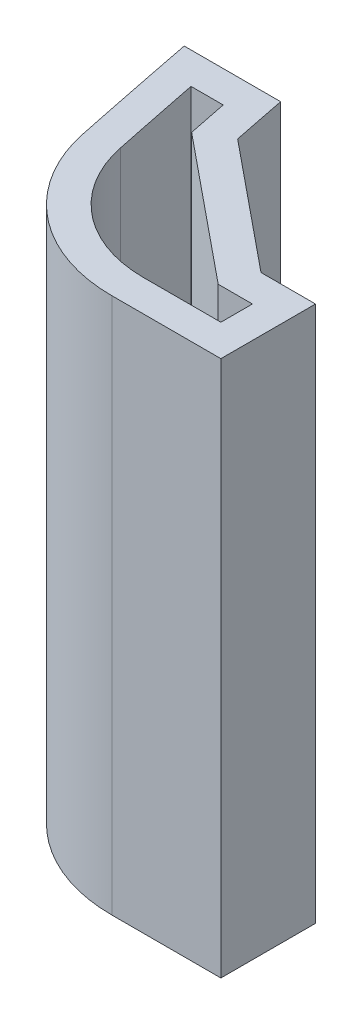
ISO-10303-21;
HEADER;
FILE_DESCRIPTION(('STEP AP214'),'2;1');
FILE_NAME('part.step','',(''),(''),'','','');
FILE_SCHEMA(('AUTOMOTIVE_DESIGN { 1 0 10303 214 1 1 1 1 }'));
ENDSEC;
DATA;
#1=APPLICATION_CONTEXT('core data for automotive mechanical design processes');
#2=APPLICATION_PROTOCOL_DEFINITION('international standard','automotive_design',2000,#1);
#3=PRODUCT_CONTEXT('',#1,'mechanical');
#4=PRODUCT('Part','Part','',(#3));
#5=PRODUCT_RELATED_PRODUCT_CATEGORY('part','',(#4));
#6=PRODUCT_DEFINITION_FORMATION('','',#4);
#7=PRODUCT_DEFINITION_CONTEXT('part definition',#1,'design');
#8=PRODUCT_DEFINITION('design','',#6,#7);
#9=PRODUCT_DEFINITION_SHAPE('','',#8);
#10=(LENGTH_UNIT() NAMED_UNIT(*) SI_UNIT(.MILLI.,.METRE.));
#11=(NAMED_UNIT(*) PLANE_ANGLE_UNIT() SI_UNIT($,.RADIAN.));
#12=(NAMED_UNIT(*) SI_UNIT($,.STERADIAN.) SOLID_ANGLE_UNIT());
#13=UNCERTAINTY_MEASURE_WITH_UNIT(LENGTH_MEASURE(1.E-05),#10,'distance_accuracy_value','');
#14=(GEOMETRIC_REPRESENTATION_CONTEXT(3) GLOBAL_UNCERTAINTY_ASSIGNED_CONTEXT((#13)) GLOBAL_UNIT_ASSIGNED_CONTEXT((#10,
#11,#12)) REPRESENTATION_CONTEXT('',''));
#15=CARTESIAN_POINT('',(0.,0.,0.));
#16=DIRECTION('',(0.,0.,1.));
#17=DIRECTION('',(1.,0.,0.));
#18=AXIS2_PLACEMENT_3D('',#15,#16,#17);
#19=CARTESIAN_POINT('',(330.920316322646,17.,-69.4714206759016));
#20=DIRECTION('',(0.,1.,0.));
#21=DIRECTION('',(0.,0.,1.));
#22=AXIS2_PLACEMENT_3D('',#19,#20,#21);
#23=PLANE('',#22);
#24=CARTESIAN_POINT('',(330.920316322646,17.,-69.4714206759016));
#25=DIRECTION('',(0.,1.,0.));
#26=DIRECTION('',(0.,0.,1.));
#27=AXIS2_PLACEMENT_3D('',#24,#25,#26);
#28=CIRCLE('',#27,341.640625);
#29=CARTESIAN_POINT('',(-4.38263124923281,17.,-3.97142067590166));
#30=VERTEX_POINT('',#29);
#31=CARTESIAN_POINT('',(-3.57280317699689,17.,0.0459847545927368));
#32=VERTEX_POINT('',#31);
#33=EDGE_CURVE('E244',#30,#32,#28,.T.);
#34=ORIENTED_EDGE('',*,*,#33,.T.);
#35=CARTESIAN_POINT('',(1.32259120854557,17.,-0.971420675901571));
#36=DIRECTION('',(0.,1.,0.));
#37=DIRECTION('',(0.,0.,1.));
#38=AXIS2_PLACEMENT_3D('',#35,#36,#37);
#39=CIRCLE('',#38,4.99999999999999);
#40=CARTESIAN_POINT('',(1.32259120854557,17.,4.02857932409845));
#41=VERTEX_POINT('',#40);
#42=EDGE_CURVE('E248',#32,#41,#39,.T.);
#43=ORIENTED_EDGE('',*,*,#42,.T.);
#44=DIRECTION('',(1.,0.,0.));
#45=VECTOR('',#44,1.);
#46=CARTESIAN_POINT('',(1.32259120854557,17.,4.02857932409845));
#47=LINE('',#46,#45);
#48=CARTESIAN_POINT('',(4.77969132264679,17.,4.02857932409843));
#49=VERTEX_POINT('',#48);
#50=EDGE_CURVE('E252',#41,#49,#47,.T.);
#51=ORIENTED_EDGE('',*,*,#50,.T.);
#52=DIRECTION('',(0.,0.,-1.));
#53=VECTOR('',#52,1.);
#54=CARTESIAN_POINT('',(4.77969132264679,17.,4.02857932409843));
#55=LINE('',#54,#53);
#56=CARTESIAN_POINT('',(4.77969132264679,17.,1.02857932409843));
#57=VERTEX_POINT('',#56);
#58=EDGE_CURVE('E255',#49,#57,#55,.T.);
#59=ORIENTED_EDGE('',*,*,#58,.T.);
#60=DIRECTION('',(-1.,0.,0.));
#61=VECTOR('',#60,1.);
#62=CARTESIAN_POINT('',(4.77969132264679,17.,1.02857932409843));
#63=LINE('',#62,#61);
#64=CARTESIAN_POINT('',(3.05114126559618,17.,1.02857932409843));
#65=VERTEX_POINT('',#64);
#66=EDGE_CURVE('E258',#57,#65,#63,.T.);
#67=ORIENTED_EDGE('',*,*,#66,.T.);
#68=DIRECTION('',(-0.774572924816624,0.,-0.632484611781994));
#69=VECTOR('',#68,1.);
#70=CARTESIAN_POINT('',(-0.98485998404807,17.,-2.2670544396782));
#71=LINE('',#70,#69);
#72=CARTESIAN_POINT('',(-0.98485998404807,17.,-2.26705443967822));
#73=VERTEX_POINT('',#72);
#74=EDGE_CURVE('E261',#65,#73,#71,.T.);
#75=ORIENTED_EDGE('',*,*,#74,.T.);
#76=CARTESIAN_POINT('',(330.920316322646,17.,-69.4714206759016));
#77=DIRECTION('',(0.,-1.,0.));
#78=DIRECTION('',(0.,0.,1.));
#79=AXIS2_PLACEMENT_3D('',#76,#77,#78);
#80=CIRCLE('',#79,338.640625);
#81=CARTESIAN_POINT('',(-1.32541036227334,17.,-3.9714206759016));
#82=VERTEX_POINT('',#81);
#83=EDGE_CURVE('E264',#73,#82,#80,.T.);
#84=ORIENTED_EDGE('',*,*,#83,.T.);
#85=DIRECTION('',(-1.,0.,0.));
#86=VECTOR('',#85,1.);
#87=CARTESIAN_POINT('',(-1.32541036227334,17.,-3.9714206759016));
#88=LINE('',#87,#86);
#89=EDGE_CURVE('E267',#82,#30,#88,.T.);
#90=ORIENTED_EDGE('',*,*,#89,.T.);
#91=EDGE_LOOP('',(#34,#43,#51,#59,#67,#75,#84,#90));
#92=FACE_BOUND('',#91,.T.);
#93=DIRECTION('',(0.,0.,-1.));
#94=VECTOR('',#93,1.);
#95=CARTESIAN_POINT('',(3.77969132264679,17.,3.02857932409842));
#96=LINE('',#95,#94);
#97=CARTESIAN_POINT('',(3.77969132264679,17.,3.02857932409842));
#98=VERTEX_POINT('',#97);
#99=CARTESIAN_POINT('',(3.77969132264679,17.,2.02857932409843));
#100=VERTEX_POINT('',#99);
#101=EDGE_CURVE('E162',#98,#100,#96,.T.);
#102=ORIENTED_EDGE('',*,*,#101,.F.);
#103=DIRECTION('',(1.,0.,0.));
#104=VECTOR('',#103,1.);
#105=CARTESIAN_POINT('',(1.32259120854557,17.,3.02857932409842));
#106=LINE('',#105,#104);
#107=CARTESIAN_POINT('',(1.32259120854557,17.,3.0285793240984));
#108=VERTEX_POINT('',#107);
#109=EDGE_CURVE('E153',#108,#98,#106,.T.);
#110=ORIENTED_EDGE('',*,*,#109,.F.);
#111=CARTESIAN_POINT('',(1.32259120854557,17.,-0.971420675901571));
#112=DIRECTION('',(0.,1.,0.));
#113=DIRECTION('',(0.,0.,1.));
#114=AXIS2_PLACEMENT_3D('',#111,#112,#113);
#115=CIRCLE('',#114,3.99999999999997);
#116=CARTESIAN_POINT('',(-2.59372429988838,17.,-0.157496331506169));
#117=VERTEX_POINT('',#116);
#118=EDGE_CURVE('E195',#117,#108,#115,.T.);
#119=ORIENTED_EDGE('',*,*,#118,.F.);
#120=CARTESIAN_POINT('',(330.920316322646,17.,-69.4714206759016));
#121=DIRECTION('',(0.,1.,0.));
#122=DIRECTION('',(0.,0.,1.));
#123=AXIS2_PLACEMENT_3D('',#120,#121,#122);
#124=CIRCLE('',#123,340.640625);
#125=CARTESIAN_POINT('',(-3.16617756836735,17.,-2.97142067590161));
#126=VERTEX_POINT('',#125);
#127=EDGE_CURVE('E192',#126,#117,#124,.T.);
#128=ORIENTED_EDGE('',*,*,#127,.F.);
#129=DIRECTION('',(-1.,0.,0.));
#130=VECTOR('',#129,1.);
#131=CARTESIAN_POINT('',(-2.14650002264843,17.,-2.97142067590161));
#132=LINE('',#131,#130);
#133=CARTESIAN_POINT('',(-2.14650002264838,17.,-2.97142067590174));
#134=VERTEX_POINT('',#133);
#135=EDGE_CURVE('E189',#134,#126,#132,.T.);
#136=ORIENTED_EDGE('',*,*,#135,.F.);
#137=CARTESIAN_POINT('',(330.920316322646,17.,-69.4714206759016));
#138=DIRECTION('',(0.,-1.,0.));
#139=DIRECTION('',(0.,0.,1.));
#140=AXIS2_PLACEMENT_3D('',#137,#138,#139);
#141=CIRCLE('',#140,339.640625);
#142=CARTESIAN_POINT('',(-1.89384041065577,17.,-1.71825670335114));
#143=VERTEX_POINT('',#142);
#144=EDGE_CURVE('E186',#143,#134,#141,.T.);
#145=ORIENTED_EDGE('',*,*,#144,.F.);
#146=DIRECTION('',(-0.774572924816624,0.,-0.632484611781995));
#147=VECTOR('',#146,1.);
#148=CARTESIAN_POINT('',(-1.89384041065577,17.,-1.71825670335114));
#149=LINE('',#148,#147);
#150=CARTESIAN_POINT('',(2.69472615132447,17.,2.02857932409843));
#151=VERTEX_POINT('',#150);
#152=EDGE_CURVE('E180',#151,#143,#149,.T.);
#153=ORIENTED_EDGE('',*,*,#152,.F.);
#154=DIRECTION('',(-1.,0.,0.));
#155=VECTOR('',#154,1.);
#156=CARTESIAN_POINT('',(3.77969132264679,17.,2.02857932409843));
#157=LINE('',#156,#155);
#158=EDGE_CURVE('E176',#100,#151,#157,.T.);
#159=ORIENTED_EDGE('',*,*,#158,.F.);
#160=EDGE_LOOP('',(#102,#110,#119,#128,#136,#145,#153,#159));
#161=FACE_BOUND('',#160,.T.);
#162=ADVANCED_FACE('F39',(#92,#161),#23,.T.);
#163=CARTESIAN_POINT('',(330.920316322646,0.,-69.4714206759016));
#164=DIRECTION('',(0.,1.,0.));
#165=DIRECTION('',(0.,0.,1.));
#166=AXIS2_PLACEMENT_3D('',#163,#164,#165);
#167=PLANE('',#166);
#168=CARTESIAN_POINT('',(330.920316322646,0.,-69.4714206759016));
#169=DIRECTION('',(0.,1.,0.));
#170=DIRECTION('',(0.,0.,1.));
#171=AXIS2_PLACEMENT_3D('',#168,#169,#170);
#172=CIRCLE('',#171,341.640625);
#173=CARTESIAN_POINT('',(-4.38263124923281,0.,-3.97142067590166));
#174=VERTEX_POINT('',#173);
#175=CARTESIAN_POINT('',(-3.57280317699689,0.,0.0459847545927368));
#176=VERTEX_POINT('',#175);
#177=EDGE_CURVE('E171',#174,#176,#172,.T.);
#178=ORIENTED_EDGE('',*,*,#177,.F.);
#179=DIRECTION('',(-1.,0.,0.));
#180=VECTOR('',#179,1.);
#181=CARTESIAN_POINT('',(-1.32541036227334,0.,-3.9714206759016));
#182=LINE('',#181,#180);
#183=CARTESIAN_POINT('',(-1.32541036227334,0.,-3.9714206759016));
#184=VERTEX_POINT('',#183);
#185=EDGE_CURVE('E249',#184,#174,#182,.T.);
#186=ORIENTED_EDGE('',*,*,#185,.F.);
#187=CARTESIAN_POINT('',(330.920316322646,0.,-69.4714206759016));
#188=DIRECTION('',(0.,-1.,0.));
#189=DIRECTION('',(0.,0.,1.));
#190=AXIS2_PLACEMENT_3D('',#187,#188,#189);
#191=CIRCLE('',#190,338.640625);
#192=CARTESIAN_POINT('',(-0.98485998404807,0.,-2.26705443967822));
#193=VERTEX_POINT('',#192);
#194=EDGE_CURVE('E289',#193,#184,#191,.T.);
#195=ORIENTED_EDGE('',*,*,#194,.F.);
#196=DIRECTION('',(-0.774572924816624,0.,-0.632484611781994));
#197=VECTOR('',#196,1.);
#198=CARTESIAN_POINT('',(-0.98485998404807,0.,-2.2670544396782));
#199=LINE('',#198,#197);
#200=CARTESIAN_POINT('',(3.05114126559618,0.,1.02857932409843));
#201=VERTEX_POINT('',#200);
#202=EDGE_CURVE('E286',#201,#193,#199,.T.);
#203=ORIENTED_EDGE('',*,*,#202,.F.);
#204=DIRECTION('',(-1.,0.,0.));
#205=VECTOR('',#204,1.);
#206=CARTESIAN_POINT('',(4.77969132264679,0.,1.02857932409843));
#207=LINE('',#206,#205);
#208=CARTESIAN_POINT('',(4.77969132264679,0.,1.02857932409843));
#209=VERTEX_POINT('',#208);
#210=EDGE_CURVE('E283',#209,#201,#207,.T.);
#211=ORIENTED_EDGE('',*,*,#210,.F.);
#212=DIRECTION('',(0.,0.,-1.));
#213=VECTOR('',#212,1.);
#214=CARTESIAN_POINT('',(4.77969132264679,0.,4.02857932409843));
#215=LINE('',#214,#213);
#216=CARTESIAN_POINT('',(4.77969132264679,0.,4.02857932409843));
#217=VERTEX_POINT('',#216);
#218=EDGE_CURVE('E280',#217,#209,#215,.T.);
#219=ORIENTED_EDGE('',*,*,#218,.F.);
#220=DIRECTION('',(1.,0.,0.));
#221=VECTOR('',#220,1.);
#222=CARTESIAN_POINT('',(1.32259120854557,0.,4.02857932409845));
#223=LINE('',#222,#221);
#224=CARTESIAN_POINT('',(1.32259120854557,0.,4.02857932409845));
#225=VERTEX_POINT('',#224);
#226=EDGE_CURVE('E277',#225,#217,#223,.T.);
#227=ORIENTED_EDGE('',*,*,#226,.F.);
#228=CARTESIAN_POINT('',(1.32259120854557,0.,-0.971420675901571));
#229=DIRECTION('',(0.,1.,0.));
#230=DIRECTION('',(0.,0.,1.));
#231=AXIS2_PLACEMENT_3D('',#228,#229,#230);
#232=CIRCLE('',#231,4.99999999999999);
#233=EDGE_CURVE('E274',#176,#225,#232,.T.);
#234=ORIENTED_EDGE('',*,*,#233,.F.);
#235=EDGE_LOOP('',(#178,#186,#195,#203,#211,#219,#227,#234));
#236=FACE_BOUND('',#235,.T.);
#237=DIRECTION('',(1.,0.,0.));
#238=VECTOR('',#237,1.);
#239=CARTESIAN_POINT('',(1.32259120854557,0.,3.02857932409842));
#240=LINE('',#239,#238);
#241=CARTESIAN_POINT('',(1.32259120854557,0.,3.0285793240984));
#242=VERTEX_POINT('',#241);
#243=CARTESIAN_POINT('',(3.77969132264679,0.,3.02857932409842));
#244=VERTEX_POINT('',#243);
#245=EDGE_CURVE('E63',#242,#244,#240,.T.);
#246=ORIENTED_EDGE('',*,*,#245,.T.);
#247=DIRECTION('',(0.,0.,-1.));
#248=VECTOR('',#247,1.);
#249=CARTESIAN_POINT('',(3.77969132264679,0.,3.02857932409842));
#250=LINE('',#249,#248);
#251=CARTESIAN_POINT('',(3.77969132264679,0.,2.02857932409843));
#252=VERTEX_POINT('',#251);
#253=EDGE_CURVE('E169',#244,#252,#250,.T.);
#254=ORIENTED_EDGE('',*,*,#253,.T.);
#255=DIRECTION('',(-1.,0.,0.));
#256=VECTOR('',#255,1.);
#257=CARTESIAN_POINT('',(3.77969132264679,0.,2.02857932409843));
#258=LINE('',#257,#256);
#259=CARTESIAN_POINT('',(2.69472615132447,0.,2.02857932409843));
#260=VERTEX_POINT('',#259);
#261=EDGE_CURVE('E203',#252,#260,#258,.T.);
#262=ORIENTED_EDGE('',*,*,#261,.T.);
#263=DIRECTION('',(-0.774572924816624,0.,-0.632484611781995));
#264=VECTOR('',#263,1.);
#265=CARTESIAN_POINT('',(-1.89384041065577,0.,-1.71825670335114));
#266=LINE('',#265,#264);
#267=CARTESIAN_POINT('',(-1.89384041065577,0.,-1.71825670335114));
#268=VERTEX_POINT('',#267);
#269=EDGE_CURVE('E207',#260,#268,#266,.T.);
#270=ORIENTED_EDGE('',*,*,#269,.T.);
#271=CARTESIAN_POINT('',(330.920316322646,0.,-69.4714206759016));
#272=DIRECTION('',(0.,-1.,0.));
#273=DIRECTION('',(0.,0.,1.));
#274=AXIS2_PLACEMENT_3D('',#271,#272,#273);
#275=CIRCLE('',#274,339.640625);
#276=CARTESIAN_POINT('',(-2.14650002264838,0.,-2.97142067590174));
#277=VERTEX_POINT('',#276);
#278=EDGE_CURVE('E211',#268,#277,#275,.T.);
#279=ORIENTED_EDGE('',*,*,#278,.T.);
#280=DIRECTION('',(-1.,0.,0.));
#281=VECTOR('',#280,1.);
#282=CARTESIAN_POINT('',(-2.14650002264843,0.,-2.97142067590161));
#283=LINE('',#282,#281);
#284=CARTESIAN_POINT('',(-3.16617756836735,0.,-2.97142067590161));
#285=VERTEX_POINT('',#284);
#286=EDGE_CURVE('E215',#277,#285,#283,.T.);
#287=ORIENTED_EDGE('',*,*,#286,.T.);
#288=CARTESIAN_POINT('',(330.920316322646,0.,-69.4714206759016));
#289=DIRECTION('',(0.,1.,0.));
#290=DIRECTION('',(0.,0.,1.));
#291=AXIS2_PLACEMENT_3D('',#288,#289,#290);
#292=CIRCLE('',#291,340.640625);
#293=CARTESIAN_POINT('',(-2.59372429988841,0.,-0.157496331506163));
#294=VERTEX_POINT('',#293);
#295=EDGE_CURVE('E219',#285,#294,#292,.T.);
#296=ORIENTED_EDGE('',*,*,#295,.T.);
#297=CARTESIAN_POINT('',(1.32259120854557,0.,-0.971420675901571));
#298=DIRECTION('',(0.,1.,0.));
#299=DIRECTION('',(0.,0.,1.));
#300=AXIS2_PLACEMENT_3D('',#297,#298,#299);
#301=CIRCLE('',#300,3.99999999999997);
#302=EDGE_CURVE('E163',#294,#242,#301,.T.);
#303=ORIENTED_EDGE('',*,*,#302,.T.);
#304=EDGE_LOOP('',(#246,#254,#262,#270,#279,#287,#296,#303));
#305=FACE_BOUND('',#304,.T.);
#306=ADVANCED_FACE('F328',(#236,#305),#167,.F.);
#307=CARTESIAN_POINT('',(330.920316322646,17.,-69.4714206759016));
#308=DIRECTION('',(0.,-1.,0.));
#309=DIRECTION('',(0.,0.,-1.));
#310=AXIS2_PLACEMENT_3D('',#307,#308,#309);
#311=CYLINDRICAL_SURFACE('',#310,341.640625);
#312=ORIENTED_EDGE('',*,*,#177,.T.);
#313=DIRECTION('',(0.,-1.,0.));
#314=VECTOR('',#313,1.);
#315=CARTESIAN_POINT('',(-3.57280317699689,17.,0.0459847545927368));
#316=LINE('',#315,#314);
#317=EDGE_CURVE('E11',#32,#176,#316,.T.);
#318=ORIENTED_EDGE('',*,*,#317,.F.);
#319=ORIENTED_EDGE('',*,*,#33,.F.);
#320=DIRECTION('',(0.,-1.,0.));
#321=VECTOR('',#320,1.);
#322=CARTESIAN_POINT('',(-4.38263124923281,17.,-3.97142067590166));
#323=LINE('',#322,#321);
#324=EDGE_CURVE('E270',#30,#174,#323,.T.);
#325=ORIENTED_EDGE('',*,*,#324,.T.);
#326=EDGE_LOOP('',(#312,#318,#319,#325));
#327=FACE_BOUND('',#326,.T.);
#328=ADVANCED_FACE('F41',(#327),#311,.T.);
#329=CARTESIAN_POINT('',(1.32259120854557,17.,-0.971420675901571));
#330=DIRECTION('',(0.,-1.,0.));
#331=DIRECTION('',(0.,0.,-1.));
#332=AXIS2_PLACEMENT_3D('',#329,#330,#331);
#333=CYLINDRICAL_SURFACE('',#332,4.99999999999999);
#334=ORIENTED_EDGE('',*,*,#233,.T.);
#335=DIRECTION('',(0.,-1.,0.));
#336=VECTOR('',#335,1.);
#337=CARTESIAN_POINT('',(1.32259120854557,17.,4.02857932409845));
#338=LINE('',#337,#336);
#339=EDGE_CURVE('E48',#41,#225,#338,.T.);
#340=ORIENTED_EDGE('',*,*,#339,.F.);
#341=ORIENTED_EDGE('',*,*,#42,.F.);
#342=ORIENTED_EDGE('',*,*,#317,.T.);
#343=EDGE_LOOP('',(#334,#340,#341,#342));
#344=FACE_BOUND('',#343,.T.);
#345=ADVANCED_FACE('F345',(#344),#333,.T.);
#346=CARTESIAN_POINT('',(1.32259120854557,17.,4.02857932409845));
#347=DIRECTION('',(0.,0.,-1.));
#348=DIRECTION('',(-1.,0.,0.));
#349=AXIS2_PLACEMENT_3D('',#346,#347,#348);
#350=PLANE('',#349);
#351=ORIENTED_EDGE('',*,*,#226,.T.);
#352=DIRECTION('',(0.,-1.,0.));
#353=VECTOR('',#352,1.);
#354=CARTESIAN_POINT('',(4.77969132264679,17.,4.02857932409843));
#355=LINE('',#354,#353);
#356=EDGE_CURVE('E313',#49,#217,#355,.T.);
#357=ORIENTED_EDGE('',*,*,#356,.F.);
#358=ORIENTED_EDGE('',*,*,#50,.F.);
#359=ORIENTED_EDGE('',*,*,#339,.T.);
#360=EDGE_LOOP('',(#351,#357,#358,#359));
#361=FACE_BOUND('',#360,.T.);
#362=ADVANCED_FACE('F322',(#361),#350,.F.);
#363=CARTESIAN_POINT('',(4.77969132264679,17.,4.02857932409843));
#364=DIRECTION('',(-1.,0.,0.));
#365=DIRECTION('',(0.,0.,1.));
#366=AXIS2_PLACEMENT_3D('',#363,#364,#365);
#367=PLANE('',#366);
#368=ORIENTED_EDGE('',*,*,#218,.T.);
#369=DIRECTION('',(0.,-1.,0.));
#370=VECTOR('',#369,1.);
#371=CARTESIAN_POINT('',(4.77969132264679,17.,1.02857932409843));
#372=LINE('',#371,#370);
#373=EDGE_CURVE('E309',#57,#209,#372,.T.);
#374=ORIENTED_EDGE('',*,*,#373,.F.);
#375=ORIENTED_EDGE('',*,*,#58,.F.);
#376=ORIENTED_EDGE('',*,*,#356,.T.);
#377=EDGE_LOOP('',(#368,#374,#375,#376));
#378=FACE_BOUND('',#377,.T.);
#379=ADVANCED_FACE('F334',(#378),#367,.F.);
#380=CARTESIAN_POINT('',(4.77969132264679,17.,1.02857932409843));
#381=DIRECTION('',(0.,0.,1.));
#382=DIRECTION('',(1.,0.,0.));
#383=AXIS2_PLACEMENT_3D('',#380,#381,#382);
#384=PLANE('',#383);
#385=ORIENTED_EDGE('',*,*,#210,.T.);
#386=DIRECTION('',(0.,-1.,0.));
#387=VECTOR('',#386,1.);
#388=CARTESIAN_POINT('',(3.05114126559618,17.,1.02857932409843));
#389=LINE('',#388,#387);
#390=EDGE_CURVE('E305',#65,#201,#389,.T.);
#391=ORIENTED_EDGE('',*,*,#390,.F.);
#392=ORIENTED_EDGE('',*,*,#66,.F.);
#393=ORIENTED_EDGE('',*,*,#373,.T.);
#394=EDGE_LOOP('',(#385,#391,#392,#393));
#395=FACE_BOUND('',#394,.T.);
#396=ADVANCED_FACE('F338',(#395),#384,.F.);
#397=CARTESIAN_POINT('',(-0.98485998404807,17.,-2.2670544396782));
#398=DIRECTION('',(-0.632484611781994,0.,0.774572924816624));
#399=DIRECTION('',(0.774572924816624,0.,0.632484611781994));
#400=AXIS2_PLACEMENT_3D('',#397,#398,#399);
#401=PLANE('',#400);
#402=CARTESIAN_POINT('',(1.03314064077405,8.5,-0.619237557789888));
#403=DIRECTION('',(0.632484611781994,0.,-0.774572924816624));
#404=DIRECTION('',(-0.774572924816625,0.,-0.632484611781994));
#405=AXIS2_PLACEMENT_3D('',#402,#403,#404);
#406=CIRCLE('',#405,1.6);
#407=CARTESIAN_POINT('',(-0.206176038932549,8.5,-1.63121293664108));
#408=VERTEX_POINT('',#407);
#409=EDGE_CURVE('E418',#408,#408,#406,.T.);
#410=ORIENTED_EDGE('',*,*,#409,.F.);
#411=EDGE_LOOP('',(#410));
#412=FACE_BOUND('',#411,.T.);
#413=ORIENTED_EDGE('',*,*,#202,.T.);
#414=DIRECTION('',(0.,-1.,0.));
#415=VECTOR('',#414,1.);
#416=CARTESIAN_POINT('',(-0.98485998404807,17.,-2.26705443967822));
#417=LINE('',#416,#415);
#418=EDGE_CURVE('E301',#73,#193,#417,.T.);
#419=ORIENTED_EDGE('',*,*,#418,.F.);
#420=ORIENTED_EDGE('',*,*,#74,.F.);
#421=ORIENTED_EDGE('',*,*,#390,.T.);
#422=EDGE_LOOP('',(#413,#419,#420,#421));
#423=FACE_BOUND('',#422,.T.);
#424=ADVANCED_FACE('F358',(#412,#423),#401,.F.);
#425=CARTESIAN_POINT('',(330.920316322646,17.,-69.4714206759016));
#426=DIRECTION('',(0.,-1.,0.));
#427=DIRECTION('',(0.,0.,-1.));
#428=AXIS2_PLACEMENT_3D('',#425,#426,#427);
#429=CYLINDRICAL_SURFACE('',#428,338.640625);
#430=ORIENTED_EDGE('',*,*,#194,.T.);
#431=DIRECTION('',(0.,-1.,0.));
#432=VECTOR('',#431,1.);
#433=CARTESIAN_POINT('',(-1.32541036227334,17.,-3.9714206759016));
#434=LINE('',#433,#432);
#435=EDGE_CURVE('E297',#82,#184,#434,.T.);
#436=ORIENTED_EDGE('',*,*,#435,.F.);
#437=ORIENTED_EDGE('',*,*,#83,.F.);
#438=ORIENTED_EDGE('',*,*,#418,.T.);
#439=EDGE_LOOP('',(#430,#436,#437,#438));
#440=FACE_BOUND('',#439,.T.);
#441=ADVANCED_FACE('F356',(#440),#429,.F.);
#442=CARTESIAN_POINT('',(-1.32541036227334,17.,-3.9714206759016));
#443=DIRECTION('',(0.,0.,1.));
#444=DIRECTION('',(1.,0.,0.));
#445=AXIS2_PLACEMENT_3D('',#442,#443,#444);
#446=PLANE('',#445);
#447=ORIENTED_EDGE('',*,*,#185,.T.);
#448=ORIENTED_EDGE('',*,*,#324,.F.);
#449=ORIENTED_EDGE('',*,*,#89,.F.);
#450=ORIENTED_EDGE('',*,*,#435,.T.);
#451=EDGE_LOOP('',(#447,#448,#449,#450));
#452=FACE_BOUND('',#451,.T.);
#453=ADVANCED_FACE('F351',(#452),#446,.F.);
#454=CARTESIAN_POINT('',(1.32259120854557,17.,3.02857932409842));
#455=DIRECTION('',(0.,0.,-1.));
#456=DIRECTION('',(-1.,0.,0.));
#457=AXIS2_PLACEMENT_3D('',#454,#455,#456);
#458=PLANE('',#457);
#459=ORIENTED_EDGE('',*,*,#245,.F.);
#460=DIRECTION('',(0.,-1.,0.));
#461=VECTOR('',#460,1.);
#462=CARTESIAN_POINT('',(1.32259120854557,17.,3.0285793240984));
#463=LINE('',#462,#461);
#464=EDGE_CURVE('E157',#108,#242,#463,.T.);
#465=ORIENTED_EDGE('',*,*,#464,.F.);
#466=ORIENTED_EDGE('',*,*,#109,.T.);
#467=DIRECTION('',(0.,-1.,0.));
#468=VECTOR('',#467,1.);
#469=CARTESIAN_POINT('',(3.77969132264679,17.,3.02857932409842));
#470=LINE('',#469,#468);
#471=EDGE_CURVE('E156',#98,#244,#470,.T.);
#472=ORIENTED_EDGE('',*,*,#471,.T.);
#473=EDGE_LOOP('',(#459,#465,#466,#472));
#474=FACE_BOUND('',#473,.T.);
#475=ADVANCED_FACE('F155',(#474),#458,.T.);
#476=CARTESIAN_POINT('',(3.77969132264679,17.,3.02857932409842));
#477=DIRECTION('',(-1.,0.,0.));
#478=DIRECTION('',(0.,0.,1.));
#479=AXIS2_PLACEMENT_3D('',#476,#477,#478);
#480=PLANE('',#479);
#481=ORIENTED_EDGE('',*,*,#253,.F.);
#482=ORIENTED_EDGE('',*,*,#471,.F.);
#483=ORIENTED_EDGE('',*,*,#101,.T.);
#484=DIRECTION('',(0.,-1.,0.));
#485=VECTOR('',#484,1.);
#486=CARTESIAN_POINT('',(3.77969132264679,17.,2.02857932409843));
#487=LINE('',#486,#485);
#488=EDGE_CURVE('E172',#100,#252,#487,.T.);
#489=ORIENTED_EDGE('',*,*,#488,.T.);
#490=EDGE_LOOP('',(#481,#482,#483,#489));
#491=FACE_BOUND('',#490,.T.);
#492=ADVANCED_FACE('F166',(#491),#480,.T.);
#493=CARTESIAN_POINT('',(3.77969132264679,17.,2.02857932409843));
#494=DIRECTION('',(0.,0.,1.));
#495=DIRECTION('',(1.,0.,0.));
#496=AXIS2_PLACEMENT_3D('',#493,#494,#495);
#497=PLANE('',#496);
#498=ORIENTED_EDGE('',*,*,#261,.F.);
#499=ORIENTED_EDGE('',*,*,#488,.F.);
#500=ORIENTED_EDGE('',*,*,#158,.T.);
#501=DIRECTION('',(0.,-1.,0.));
#502=VECTOR('',#501,1.);
#503=CARTESIAN_POINT('',(2.69472615132447,17.,2.02857932409843));
#504=LINE('',#503,#502);
#505=EDGE_CURVE('E239',#151,#260,#504,.T.);
#506=ORIENTED_EDGE('',*,*,#505,.T.);
#507=EDGE_LOOP('',(#498,#499,#500,#506));
#508=FACE_BOUND('',#507,.T.);
#509=ADVANCED_FACE('F385',(#508),#497,.T.);
#510=CARTESIAN_POINT('',(-1.89384041065577,17.,-1.71825670335114));
#511=DIRECTION('',(-0.632484611781995,0.,0.774572924816624));
#512=DIRECTION('',(0.774572924816624,0.,0.632484611781995));
#513=AXIS2_PLACEMENT_3D('',#510,#511,#512);
#514=PLANE('',#513);
#515=CARTESIAN_POINT('',(0.400656028992058,8.5,0.155335367026734));
#516=DIRECTION('',(-0.632484611781995,0.,0.774572924816624));
#517=DIRECTION('',(0.774572924816624,0.,0.632484611781995));
#518=AXIS2_PLACEMENT_3D('',#515,#516,#517);
#519=CIRCLE('',#518,1.6);
#520=CARTESIAN_POINT('',(1.63997270869866,8.5,1.16731074587793));
#521=VERTEX_POINT('',#520);
#522=EDGE_CURVE('E200',#521,#521,#519,.F.);
#523=ORIENTED_EDGE('',*,*,#522,.T.);
#524=EDGE_LOOP('',(#523));
#525=FACE_BOUND('',#524,.T.);
#526=ORIENTED_EDGE('',*,*,#269,.F.);
#527=ORIENTED_EDGE('',*,*,#505,.F.);
#528=ORIENTED_EDGE('',*,*,#152,.T.);
#529=DIRECTION('',(0.,-1.,0.));
#530=VECTOR('',#529,1.);
#531=CARTESIAN_POINT('',(-1.89384041065577,17.,-1.71825670335114));
#532=LINE('',#531,#530);
#533=EDGE_CURVE('E236',#143,#268,#532,.T.);
#534=ORIENTED_EDGE('',*,*,#533,.T.);
#535=EDGE_LOOP('',(#526,#527,#528,#534));
#536=FACE_BOUND('',#535,.T.);
#537=ADVANCED_FACE('F389',(#525,#536),#514,.T.);
#538=CARTESIAN_POINT('',(330.920316322646,17.,-69.4714206759016));
#539=DIRECTION('',(0.,-1.,0.));
#540=DIRECTION('',(0.,0.,-1.));
#541=AXIS2_PLACEMENT_3D('',#538,#539,#540);
#542=CYLINDRICAL_SURFACE('',#541,339.640625);
#543=ORIENTED_EDGE('',*,*,#278,.F.);
#544=ORIENTED_EDGE('',*,*,#533,.F.);
#545=ORIENTED_EDGE('',*,*,#144,.T.);
#546=DIRECTION('',(0.,-1.,0.));
#547=VECTOR('',#546,1.);
#548=CARTESIAN_POINT('',(-2.14650002264838,17.,-2.97142067590174));
#549=LINE('',#548,#547);
#550=EDGE_CURVE('E233',#134,#277,#549,.T.);
#551=ORIENTED_EDGE('',*,*,#550,.T.);
#552=EDGE_LOOP('',(#543,#544,#545,#551));
#553=FACE_BOUND('',#552,.T.);
#554=ADVANCED_FACE('F395',(#553),#542,.T.);
#555=CARTESIAN_POINT('',(-2.14650002264843,17.,-2.97142067590161));
#556=DIRECTION('',(0.,0.,1.));
#557=DIRECTION('',(1.,0.,0.));
#558=AXIS2_PLACEMENT_3D('',#555,#556,#557);
#559=PLANE('',#558);
#560=ORIENTED_EDGE('',*,*,#286,.F.);
#561=ORIENTED_EDGE('',*,*,#550,.F.);
#562=ORIENTED_EDGE('',*,*,#135,.T.);
#563=DIRECTION('',(0.,-1.,0.));
#564=VECTOR('',#563,1.);
#565=CARTESIAN_POINT('',(-3.16617756836735,17.,-2.97142067590161));
#566=LINE('',#565,#564);
#567=EDGE_CURVE('E230',#126,#285,#566,.T.);
#568=ORIENTED_EDGE('',*,*,#567,.T.);
#569=EDGE_LOOP('',(#560,#561,#562,#568));
#570=FACE_BOUND('',#569,.T.);
#571=ADVANCED_FACE('F399',(#570),#559,.T.);
#572=CARTESIAN_POINT('',(330.920316322646,17.,-69.4714206759016));
#573=DIRECTION('',(0.,-1.,0.));
#574=DIRECTION('',(0.,0.,-1.));
#575=AXIS2_PLACEMENT_3D('',#572,#573,#574);
#576=CYLINDRICAL_SURFACE('',#575,340.640625);
#577=ORIENTED_EDGE('',*,*,#295,.F.);
#578=ORIENTED_EDGE('',*,*,#567,.F.);
#579=ORIENTED_EDGE('',*,*,#127,.T.);
#580=DIRECTION('',(0.,-1.,0.));
#581=VECTOR('',#580,1.);
#582=CARTESIAN_POINT('',(-2.59372429988841,17.,-0.157496331506163));
#583=LINE('',#582,#581);
#584=EDGE_CURVE('E55',#117,#294,#583,.T.);
#585=ORIENTED_EDGE('',*,*,#584,.T.);
#586=EDGE_LOOP('',(#577,#578,#579,#585));
#587=FACE_BOUND('',#586,.T.);
#588=ADVANCED_FACE('F403',(#587),#576,.F.);
#589=CARTESIAN_POINT('',(1.32259120854557,17.,-0.971420675901571));
#590=DIRECTION('',(0.,-1.,0.));
#591=DIRECTION('',(0.,0.,-1.));
#592=AXIS2_PLACEMENT_3D('',#589,#590,#591);
#593=CYLINDRICAL_SURFACE('',#592,3.99999999999997);
#594=ORIENTED_EDGE('',*,*,#302,.F.);
#595=ORIENTED_EDGE('',*,*,#584,.F.);
#596=ORIENTED_EDGE('',*,*,#118,.T.);
#597=ORIENTED_EDGE('',*,*,#464,.T.);
#598=EDGE_LOOP('',(#594,#595,#596,#597));
#599=FACE_BOUND('',#598,.T.);
#600=ADVANCED_FACE('F407',(#599),#593,.F.);
#601=CARTESIAN_POINT('',(-2.46164258212595,8.5,3.66065228005927));
#602=DIRECTION('',(0.632484611781994,0.,-0.774572924816624));
#603=DIRECTION('',(-0.774572924816624,0.,-0.632484611781994));
#604=AXIS2_PLACEMENT_3D('',#601,#602,#603);
#605=CYLINDRICAL_SURFACE('',#604,1.6);
#606=ORIENTED_EDGE('',*,*,#409,.T.);
#607=EDGE_LOOP('',(#606));
#608=FACE_BOUND('',#607,.T.);
#609=ORIENTED_EDGE('',*,*,#522,.F.);
#610=EDGE_LOOP('',(#609));
#611=FACE_BOUND('',#610,.T.);
#612=ADVANCED_FACE('F411',(#608,#611),#605,.F.);
#613=CLOSED_SHELL('',(#162,#306,#328,#345,#362,#379,#396,#424,#441,#453,#475,#492,#509,#537,
#554,#571,#588,#600,#612));
#614=MANIFOLD_SOLID_BREP('B2',#613);
#615=ADVANCED_BREP_SHAPE_REPRESENTATION('',(#18,#614),#14);
#616=SHAPE_DEFINITION_REPRESENTATION(#9,#615);
ENDSEC;
END-ISO-10303-21;
